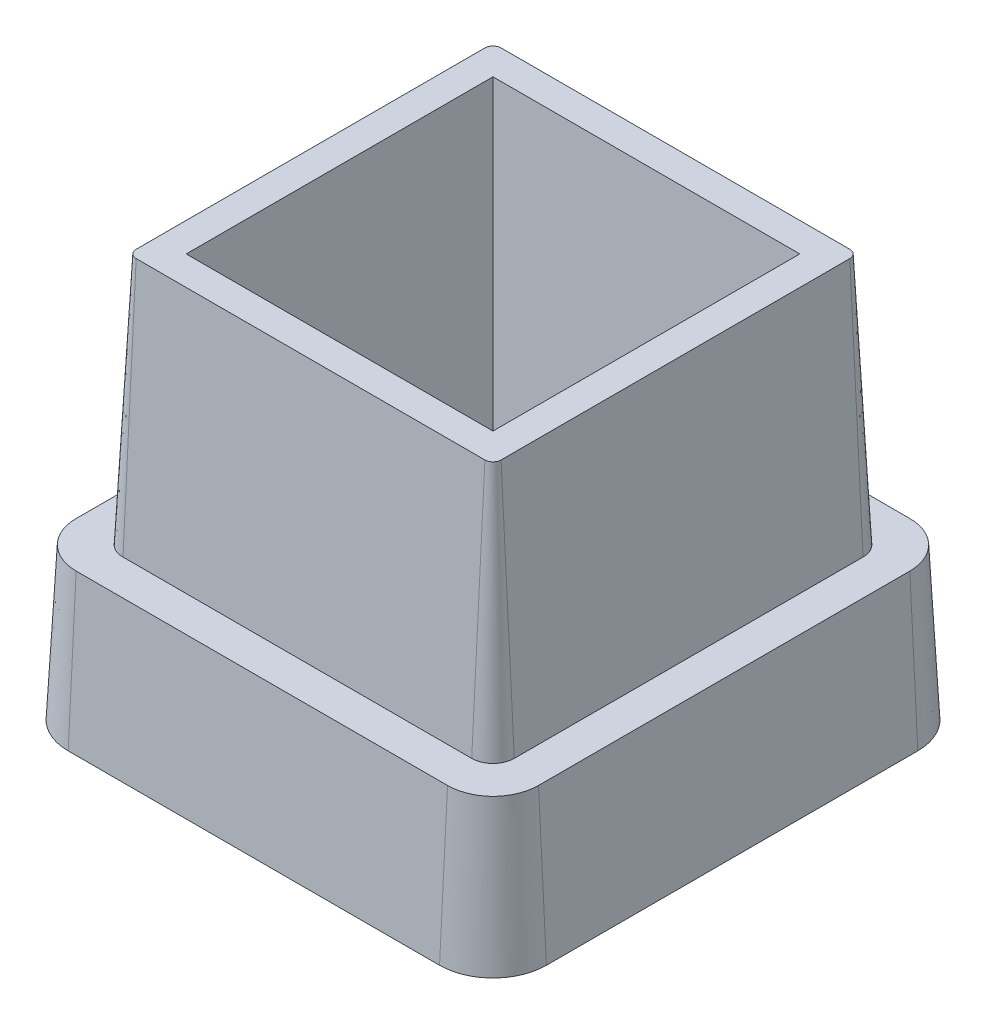
ISO-10303-21;
HEADER;
FILE_DESCRIPTION(('STEP AP214'),'2;1');
FILE_NAME('part.step','',(''),(''),'','','');
FILE_SCHEMA(('AUTOMOTIVE_DESIGN { 1 0 10303 214 1 1 1 1 }'));
ENDSEC;
DATA;
#1=APPLICATION_CONTEXT('core data for automotive mechanical design processes');
#2=APPLICATION_PROTOCOL_DEFINITION('international standard','automotive_design',2000,#1);
#3=PRODUCT_CONTEXT('',#1,'mechanical');
#4=PRODUCT('Part','Part','',(#3));
#5=PRODUCT_RELATED_PRODUCT_CATEGORY('part','',(#4));
#6=PRODUCT_DEFINITION_FORMATION('','',#4);
#7=PRODUCT_DEFINITION_CONTEXT('part definition',#1,'design');
#8=PRODUCT_DEFINITION('design','',#6,#7);
#9=PRODUCT_DEFINITION_SHAPE('','',#8);
#10=(LENGTH_UNIT() NAMED_UNIT(*) SI_UNIT(.MILLI.,.METRE.));
#11=(NAMED_UNIT(*) PLANE_ANGLE_UNIT() SI_UNIT($,.RADIAN.));
#12=(NAMED_UNIT(*) SI_UNIT($,.STERADIAN.) SOLID_ANGLE_UNIT());
#13=UNCERTAINTY_MEASURE_WITH_UNIT(LENGTH_MEASURE(1.E-05),#10,'distance_accuracy_value','');
#14=(GEOMETRIC_REPRESENTATION_CONTEXT(3) GLOBAL_UNCERTAINTY_ASSIGNED_CONTEXT((#13)) GLOBAL_UNIT_ASSIGNED_CONTEXT((#10,
#11,#12)) REPRESENTATION_CONTEXT('',''));
#15=CARTESIAN_POINT('',(0.,0.,0.));
#16=DIRECTION('',(0.,0.,1.));
#17=DIRECTION('',(1.,0.,0.));
#18=AXIS2_PLACEMENT_3D('',#15,#16,#17);
#19=CARTESIAN_POINT('',(-13.5,25.,0.));
#20=DIRECTION('',(-0.998629534754574,0.0523359562429439,0.));
#21=DIRECTION('',(-0.052335956242944,-0.998629534754574,0.));
#22=AXIS2_PLACEMENT_3D('',#19,#20,#21);
#23=PLANE('',#22);
#24=DIRECTION('',(0.,0.,-1.));
#25=VECTOR('',#24,1.);
#26=CARTESIAN_POINT('',(-14.810194482076,0.,0.));
#27=LINE('',#26,#25);
#28=CARTESIAN_POINT('',(-14.810194482076,0.,-11.5));
#29=VERTEX_POINT('',#28);
#30=CARTESIAN_POINT('',(-14.810194482076,0.,11.5));
#31=VERTEX_POINT('',#30);
#32=EDGE_CURVE('E259',#29,#31,#27,.F.);
#33=ORIENTED_EDGE('',*,*,#32,.T.);
#34=DIRECTION('',(-0.0523359562429439,-0.998629534754574,0.));
#35=VECTOR('',#34,1.);
#36=CARTESIAN_POINT('',(-13.5,25.,11.5));
#37=LINE('',#36,#35);
#38=CARTESIAN_POINT('',(-14.3175613568155,9.4,11.5));
#39=VERTEX_POINT('',#38);
#40=EDGE_CURVE('E211',#31,#39,#37,.F.);
#41=ORIENTED_EDGE('',*,*,#40,.T.);
#42=DIRECTION('',(0.,0.,-1.));
#43=VECTOR('',#42,1.);
#44=CARTESIAN_POINT('',(-14.3175613568155,9.4,0.));
#45=LINE('',#44,#43);
#46=CARTESIAN_POINT('',(-14.3175613568155,9.4,-11.5));
#47=VERTEX_POINT('',#46);
#48=EDGE_CURVE('E261',#47,#39,#45,.F.);
#49=ORIENTED_EDGE('',*,*,#48,.F.);
#50=DIRECTION('',(-0.0523359562429439,-0.998629534754574,0.));
#51=VECTOR('',#50,1.);
#52=CARTESIAN_POINT('',(-13.5,25.,-11.5));
#53=LINE('',#52,#51);
#54=EDGE_CURVE('E214',#47,#29,#53,.T.);
#55=ORIENTED_EDGE('',*,*,#54,.T.);
#56=EDGE_LOOP('',(#33,#41,#49,#55));
#57=FACE_BOUND('',#56,.T.);
#58=ADVANCED_FACE('F35',(#57),#23,.T.);
#59=CARTESIAN_POINT('',(0.,25.,13.5));
#60=DIRECTION('',(0.,0.0523359562429439,0.998629534754574));
#61=DIRECTION('',(0.,-0.998629534754574,0.052335956242944));
#62=AXIS2_PLACEMENT_3D('',#59,#60,#61);
#63=PLANE('',#62);
#64=DIRECTION('',(-1.,0.,0.));
#65=VECTOR('',#64,1.);
#66=CARTESIAN_POINT('',(0.,9.4,14.3175613568154));
#67=LINE('',#66,#65);
#68=CARTESIAN_POINT('',(-11.5,9.4,14.3175613568154));
#69=VERTEX_POINT('',#68);
#70=CARTESIAN_POINT('',(11.5,9.4,14.3175613568154));
#71=VERTEX_POINT('',#70);
#72=EDGE_CURVE('E254',#69,#71,#67,.F.);
#73=ORIENTED_EDGE('',*,*,#72,.F.);
#74=DIRECTION('',(0.,-0.998629534754574,0.0523359562429439));
#75=VECTOR('',#74,1.);
#76=CARTESIAN_POINT('',(-11.5,25.,13.5));
#77=LINE('',#76,#75);
#78=CARTESIAN_POINT('',(-11.5,0.,14.810194482076));
#79=VERTEX_POINT('',#78);
#80=EDGE_CURVE('E209',#69,#79,#77,.T.);
#81=ORIENTED_EDGE('',*,*,#80,.T.);
#82=DIRECTION('',(-1.,0.,0.));
#83=VECTOR('',#82,1.);
#84=CARTESIAN_POINT('',(0.,0.,14.810194482076));
#85=LINE('',#84,#83);
#86=CARTESIAN_POINT('',(11.5,0.,14.810194482076));
#87=VERTEX_POINT('',#86);
#88=EDGE_CURVE('E273',#79,#87,#85,.F.);
#89=ORIENTED_EDGE('',*,*,#88,.T.);
#90=DIRECTION('',(0.,-0.998629534754574,0.0523359562429439));
#91=VECTOR('',#90,1.);
#92=CARTESIAN_POINT('',(11.5,25.,13.5));
#93=LINE('',#92,#91);
#94=EDGE_CURVE('E207',#87,#71,#93,.F.);
#95=ORIENTED_EDGE('',*,*,#94,.T.);
#96=EDGE_LOOP('',(#73,#81,#89,#95));
#97=FACE_BOUND('',#96,.T.);
#98=ADVANCED_FACE('F344',(#97),#63,.T.);
#99=CARTESIAN_POINT('',(13.5,25.,0.));
#100=DIRECTION('',(0.998629534754574,0.0523359562429439,0.));
#101=DIRECTION('',(-0.052335956242944,0.998629534754574,0.));
#102=AXIS2_PLACEMENT_3D('',#99,#100,#101);
#103=PLANE('',#102);
#104=DIRECTION('',(0.,0.,1.));
#105=VECTOR('',#104,1.);
#106=CARTESIAN_POINT('',(14.3175613568154,9.4,0.));
#107=LINE('',#106,#105);
#108=CARTESIAN_POINT('',(14.3175613568154,9.4,11.5));
#109=VERTEX_POINT('',#108);
#110=CARTESIAN_POINT('',(14.3175613568154,9.4,-11.5));
#111=VERTEX_POINT('',#110);
#112=EDGE_CURVE('E250',#109,#111,#107,.F.);
#113=ORIENTED_EDGE('',*,*,#112,.F.);
#114=DIRECTION('',(0.0523359562429439,-0.998629534754574,0.));
#115=VECTOR('',#114,1.);
#116=CARTESIAN_POINT('',(13.5,25.,11.5));
#117=LINE('',#116,#115);
#118=CARTESIAN_POINT('',(14.810194482076,0.,11.5));
#119=VERTEX_POINT('',#118);
#120=EDGE_CURVE('E205',#109,#119,#117,.T.);
#121=ORIENTED_EDGE('',*,*,#120,.T.);
#122=DIRECTION('',(0.,0.,1.));
#123=VECTOR('',#122,1.);
#124=CARTESIAN_POINT('',(14.810194482076,0.,0.));
#125=LINE('',#124,#123);
#126=CARTESIAN_POINT('',(14.810194482076,0.,-11.5));
#127=VERTEX_POINT('',#126);
#128=EDGE_CURVE('E269',#119,#127,#125,.F.);
#129=ORIENTED_EDGE('',*,*,#128,.T.);
#130=DIRECTION('',(0.0523359562429439,-0.998629534754574,0.));
#131=VECTOR('',#130,1.);
#132=CARTESIAN_POINT('',(13.5,25.,-11.5));
#133=LINE('',#132,#131);
#134=EDGE_CURVE('E202',#127,#111,#133,.F.);
#135=ORIENTED_EDGE('',*,*,#134,.T.);
#136=EDGE_LOOP('',(#113,#121,#129,#135));
#137=FACE_BOUND('',#136,.T.);
#138=ADVANCED_FACE('F350',(#137),#103,.T.);
#139=CARTESIAN_POINT('',(0.,25.,-13.5));
#140=DIRECTION('',(0.,0.0523359562429439,-0.998629534754574));
#141=DIRECTION('',(0.,0.998629534754574,0.052335956242944));
#142=AXIS2_PLACEMENT_3D('',#139,#140,#141);
#143=PLANE('',#142);
#144=DIRECTION('',(1.,0.,0.));
#145=VECTOR('',#144,1.);
#146=CARTESIAN_POINT('',(0.,9.4,-14.3175613568154));
#147=LINE('',#146,#145);
#148=CARTESIAN_POINT('',(11.5,9.4,-14.3175613568154));
#149=VERTEX_POINT('',#148);
#150=CARTESIAN_POINT('',(-11.5,9.4,-14.3175613568154));
#151=VERTEX_POINT('',#150);
#152=EDGE_CURVE('E253',#149,#151,#147,.F.);
#153=ORIENTED_EDGE('',*,*,#152,.F.);
#154=DIRECTION('',(0.,-0.998629534754574,-0.0523359562429439));
#155=VECTOR('',#154,1.);
#156=CARTESIAN_POINT('',(11.5,25.,-13.5));
#157=LINE('',#156,#155);
#158=CARTESIAN_POINT('',(11.5,0.,-14.810194482076));
#159=VERTEX_POINT('',#158);
#160=EDGE_CURVE('E11',#149,#159,#157,.T.);
#161=ORIENTED_EDGE('',*,*,#160,.T.);
#162=DIRECTION('',(1.,0.,0.));
#163=VECTOR('',#162,1.);
#164=CARTESIAN_POINT('',(0.,0.,-14.810194482076));
#165=LINE('',#164,#163);
#166=CARTESIAN_POINT('',(-11.5,0.,-14.810194482076));
#167=VERTEX_POINT('',#166);
#168=EDGE_CURVE('E272',#159,#167,#165,.F.);
#169=ORIENTED_EDGE('',*,*,#168,.T.);
#170=DIRECTION('',(0.,-0.998629534754574,-0.0523359562429439));
#171=VECTOR('',#170,1.);
#172=CARTESIAN_POINT('',(-11.5,25.,-13.5));
#173=LINE('',#172,#171);
#174=EDGE_CURVE('E45',#167,#151,#173,.F.);
#175=ORIENTED_EDGE('',*,*,#174,.T.);
#176=EDGE_LOOP('',(#153,#161,#169,#175));
#177=FACE_BOUND('',#176,.T.);
#178=ADVANCED_FACE('F392',(#177),#143,.T.);
#179=CARTESIAN_POINT('',(0.,0.,0.));
#180=DIRECTION('',(0.,1.,0.));
#181=DIRECTION('',(0.,0.,1.));
#182=AXIS2_PLACEMENT_3D('',#179,#180,#181);
#183=PLANE('',#182);
#184=ORIENTED_EDGE('',*,*,#88,.F.);
#185=CARTESIAN_POINT('',(-11.5,0.,11.5));
#186=DIRECTION('',(0.,1.,0.));
#187=DIRECTION('',(0.,0.,1.));
#188=AXIS2_PLACEMENT_3D('',#185,#186,#187);
#189=CIRCLE('',#188,3.31019448207603);
#190=EDGE_CURVE('E248',#79,#31,#189,.F.);
#191=ORIENTED_EDGE('',*,*,#190,.T.);
#192=ORIENTED_EDGE('',*,*,#32,.F.);
#193=CARTESIAN_POINT('',(-11.5,0.,-11.5));
#194=DIRECTION('',(0.,1.,0.));
#195=DIRECTION('',(0.,0.,1.));
#196=AXIS2_PLACEMENT_3D('',#193,#194,#195);
#197=CIRCLE('',#196,3.31019448207603);
#198=EDGE_CURVE('E246',#29,#167,#197,.F.);
#199=ORIENTED_EDGE('',*,*,#198,.T.);
#200=ORIENTED_EDGE('',*,*,#168,.F.);
#201=CARTESIAN_POINT('',(11.5,0.,-11.5));
#202=DIRECTION('',(0.,1.,0.));
#203=DIRECTION('',(0.,0.,1.));
#204=AXIS2_PLACEMENT_3D('',#201,#202,#203);
#205=CIRCLE('',#204,3.31019448207603);
#206=EDGE_CURVE('E276',#159,#127,#205,.F.);
#207=ORIENTED_EDGE('',*,*,#206,.T.);
#208=ORIENTED_EDGE('',*,*,#128,.F.);
#209=CARTESIAN_POINT('',(11.5,0.,11.5));
#210=DIRECTION('',(0.,1.,0.));
#211=DIRECTION('',(0.,0.,1.));
#212=AXIS2_PLACEMENT_3D('',#209,#210,#211);
#213=CIRCLE('',#212,3.31019448207603);
#214=EDGE_CURVE('E274',#119,#87,#213,.F.);
#215=ORIENTED_EDGE('',*,*,#214,.T.);
#216=EDGE_LOOP('',(#184,#191,#192,#199,#200,#207,#208,#215));
#217=FACE_BOUND('',#216,.T.);
#218=ADVANCED_FACE('F394',(#217),#183,.F.);
#219=CARTESIAN_POINT('',(0.,9.4,0.));
#220=DIRECTION('',(0.,1.,0.));
#221=DIRECTION('',(0.,0.,1.));
#222=AXIS2_PLACEMENT_3D('',#219,#220,#221);
#223=PLANE('',#222);
#224=DIRECTION('',(0.,0.,1.));
#225=VECTOR('',#224,1.);
#226=CARTESIAN_POINT('',(-12.1175613568155,9.4,0.));
#227=LINE('',#226,#225);
#228=CARTESIAN_POINT('',(-12.1175613568155,9.4,-10.8));
#229=VERTEX_POINT('',#228);
#230=CARTESIAN_POINT('',(-12.1175613568155,9.4,10.8));
#231=VERTEX_POINT('',#230);
#232=EDGE_CURVE('E264',#229,#231,#227,.T.);
#233=ORIENTED_EDGE('',*,*,#232,.F.);
#234=CARTESIAN_POINT('',(-10.8,9.4,-10.8));
#235=DIRECTION('',(0.,1.,0.));
#236=DIRECTION('',(0.,0.,1.));
#237=AXIS2_PLACEMENT_3D('',#234,#235,#236);
#238=CIRCLE('',#237,1.31756135681544);
#239=CARTESIAN_POINT('',(-10.8,9.4,-12.1175613568154));
#240=VERTEX_POINT('',#239);
#241=EDGE_CURVE('E290',#229,#240,#238,.F.);
#242=ORIENTED_EDGE('',*,*,#241,.T.);
#243=DIRECTION('',(-1.,0.,0.));
#244=VECTOR('',#243,1.);
#245=CARTESIAN_POINT('',(0.,9.4,-12.1175613568154));
#246=LINE('',#245,#244);
#247=CARTESIAN_POINT('',(10.8,9.4,-12.1175613568154));
#248=VERTEX_POINT('',#247);
#249=EDGE_CURVE('E293',#248,#240,#246,.T.);
#250=ORIENTED_EDGE('',*,*,#249,.F.);
#251=CARTESIAN_POINT('',(10.8,9.4,-10.8));
#252=DIRECTION('',(0.,1.,0.));
#253=DIRECTION('',(0.,0.,1.));
#254=AXIS2_PLACEMENT_3D('',#251,#252,#253);
#255=CIRCLE('',#254,1.31756135681544);
#256=CARTESIAN_POINT('',(12.1175613568154,9.4,-10.8));
#257=VERTEX_POINT('',#256);
#258=EDGE_CURVE('E210',#248,#257,#255,.F.);
#259=ORIENTED_EDGE('',*,*,#258,.T.);
#260=DIRECTION('',(0.,0.,-1.));
#261=VECTOR('',#260,1.);
#262=CARTESIAN_POINT('',(12.1175613568154,9.4,0.));
#263=LINE('',#262,#261);
#264=CARTESIAN_POINT('',(12.1175613568154,9.4,10.8));
#265=VERTEX_POINT('',#264);
#266=EDGE_CURVE('E296',#265,#257,#263,.T.);
#267=ORIENTED_EDGE('',*,*,#266,.F.);
#268=CARTESIAN_POINT('',(10.8,9.4,10.8));
#269=DIRECTION('',(0.,1.,0.));
#270=DIRECTION('',(0.,0.,1.));
#271=AXIS2_PLACEMENT_3D('',#268,#269,#270);
#272=CIRCLE('',#271,1.31756135681544);
#273=CARTESIAN_POINT('',(10.8,9.4,12.1175613568154));
#274=VERTEX_POINT('',#273);
#275=EDGE_CURVE('E292',#265,#274,#272,.F.);
#276=ORIENTED_EDGE('',*,*,#275,.T.);
#277=DIRECTION('',(1.,0.,0.));
#278=VECTOR('',#277,1.);
#279=CARTESIAN_POINT('',(0.,9.4,12.1175613568154));
#280=LINE('',#279,#278);
#281=CARTESIAN_POINT('',(-10.8,9.4,12.1175613568154));
#282=VERTEX_POINT('',#281);
#283=EDGE_CURVE('E300',#282,#274,#280,.T.);
#284=ORIENTED_EDGE('',*,*,#283,.F.);
#285=CARTESIAN_POINT('',(-10.8,9.4,10.8));
#286=DIRECTION('',(0.,1.,0.));
#287=DIRECTION('',(0.,0.,1.));
#288=AXIS2_PLACEMENT_3D('',#285,#286,#287);
#289=CIRCLE('',#288,1.31756135681544);
#290=EDGE_CURVE('E288',#282,#231,#289,.F.);
#291=ORIENTED_EDGE('',*,*,#290,.T.);
#292=EDGE_LOOP('',(#233,#242,#250,#259,#267,#276,#284,#291));
#293=FACE_BOUND('',#292,.T.);
#294=ORIENTED_EDGE('',*,*,#48,.T.);
#295=CARTESIAN_POINT('',(-11.5,9.4,11.5));
#296=DIRECTION('',(0.,1.,0.));
#297=DIRECTION('',(0.,0.,1.));
#298=AXIS2_PLACEMENT_3D('',#295,#296,#297);
#299=CIRCLE('',#298,2.81756135681544);
#300=EDGE_CURVE('E206',#39,#69,#299,.T.);
#301=ORIENTED_EDGE('',*,*,#300,.T.);
#302=ORIENTED_EDGE('',*,*,#72,.T.);
#303=CARTESIAN_POINT('',(11.5,9.4,11.5));
#304=DIRECTION('',(0.,1.,0.));
#305=DIRECTION('',(0.,0.,1.));
#306=AXIS2_PLACEMENT_3D('',#303,#304,#305);
#307=CIRCLE('',#306,2.81756135681544);
#308=EDGE_CURVE('E257',#71,#109,#307,.T.);
#309=ORIENTED_EDGE('',*,*,#308,.T.);
#310=ORIENTED_EDGE('',*,*,#112,.T.);
#311=CARTESIAN_POINT('',(11.5,9.4,-11.5));
#312=DIRECTION('',(0.,1.,0.));
#313=DIRECTION('',(0.,0.,1.));
#314=AXIS2_PLACEMENT_3D('',#311,#312,#313);
#315=CIRCLE('',#314,2.81756135681544);
#316=EDGE_CURVE('E255',#111,#149,#315,.T.);
#317=ORIENTED_EDGE('',*,*,#316,.T.);
#318=ORIENTED_EDGE('',*,*,#152,.T.);
#319=CARTESIAN_POINT('',(-11.5,9.4,-11.5));
#320=DIRECTION('',(0.,1.,0.));
#321=DIRECTION('',(0.,0.,1.));
#322=AXIS2_PLACEMENT_3D('',#319,#320,#321);
#323=CIRCLE('',#322,2.81756135681544);
#324=EDGE_CURVE('E213',#151,#47,#323,.T.);
#325=ORIENTED_EDGE('',*,*,#324,.T.);
#326=EDGE_LOOP('',(#294,#301,#302,#309,#310,#317,#318,#325));
#327=FACE_BOUND('',#326,.T.);
#328=ADVANCED_FACE('F383',(#293,#327),#223,.T.);
#329=CARTESIAN_POINT('',(0.,25.,11.3));
#330=DIRECTION('',(0.,0.0523359562429439,0.998629534754574));
#331=DIRECTION('',(0.,-0.998629534754574,0.052335956242944));
#332=AXIS2_PLACEMENT_3D('',#329,#330,#331);
#333=PLANE('',#332);
#334=DIRECTION('',(1.,0.,0.));
#335=VECTOR('',#334,1.);
#336=CARTESIAN_POINT('',(0.,25.,11.3));
#337=LINE('',#336,#335);
#338=CARTESIAN_POINT('',(-10.8,25.,11.3));
#339=VERTEX_POINT('',#338);
#340=CARTESIAN_POINT('',(10.8,25.,11.3));
#341=VERTEX_POINT('',#340);
#342=EDGE_CURVE('E309',#339,#341,#337,.T.);
#343=ORIENTED_EDGE('',*,*,#342,.F.);
#344=DIRECTION('',(0.,-0.998629534754574,0.0523359562429439));
#345=VECTOR('',#344,1.);
#346=CARTESIAN_POINT('',(-10.8,25.,11.3));
#347=LINE('',#346,#345);
#348=EDGE_CURVE('E226',#339,#282,#347,.T.);
#349=ORIENTED_EDGE('',*,*,#348,.T.);
#350=ORIENTED_EDGE('',*,*,#283,.T.);
#351=DIRECTION('',(0.,-0.998629534754574,0.0523359562429439));
#352=VECTOR('',#351,1.);
#353=CARTESIAN_POINT('',(10.8,25.,11.3));
#354=LINE('',#353,#352);
#355=EDGE_CURVE('E224',#274,#341,#354,.F.);
#356=ORIENTED_EDGE('',*,*,#355,.T.);
#357=EDGE_LOOP('',(#343,#349,#350,#356));
#358=FACE_BOUND('',#357,.T.);
#359=ADVANCED_FACE('F361',(#358),#333,.T.);
#360=CARTESIAN_POINT('',(-11.3,25.,0.));
#361=DIRECTION('',(-0.998629534754574,0.0523359562429439,0.));
#362=DIRECTION('',(-0.052335956242944,-0.998629534754574,0.));
#363=AXIS2_PLACEMENT_3D('',#360,#361,#362);
#364=PLANE('',#363);
#365=ORIENTED_EDGE('',*,*,#232,.T.);
#366=DIRECTION('',(-0.0523359562429439,-0.998629534754574,0.));
#367=VECTOR('',#366,1.);
#368=CARTESIAN_POINT('',(-11.3,25.,10.8));
#369=LINE('',#368,#367);
#370=CARTESIAN_POINT('',(-11.3,25.,10.8));
#371=VERTEX_POINT('',#370);
#372=EDGE_CURVE('E220',#231,#371,#369,.F.);
#373=ORIENTED_EDGE('',*,*,#372,.T.);
#374=DIRECTION('',(0.,0.,1.));
#375=VECTOR('',#374,1.);
#376=CARTESIAN_POINT('',(-11.3,25.,0.));
#377=LINE('',#376,#375);
#378=CARTESIAN_POINT('',(-11.3,25.,-10.8));
#379=VERTEX_POINT('',#378);
#380=EDGE_CURVE('E303',#379,#371,#377,.T.);
#381=ORIENTED_EDGE('',*,*,#380,.F.);
#382=DIRECTION('',(-0.0523359562429439,-0.998629534754574,0.));
#383=VECTOR('',#382,1.);
#384=CARTESIAN_POINT('',(-11.3,25.,-10.8));
#385=LINE('',#384,#383);
#386=EDGE_CURVE('E223',#379,#229,#385,.T.);
#387=ORIENTED_EDGE('',*,*,#386,.T.);
#388=EDGE_LOOP('',(#365,#373,#381,#387));
#389=FACE_BOUND('',#388,.T.);
#390=ADVANCED_FACE('F357',(#389),#364,.T.);
#391=CARTESIAN_POINT('',(0.,25.,-11.3));
#392=DIRECTION('',(0.,0.0523359562429439,-0.998629534754574));
#393=DIRECTION('',(0.,0.998629534754574,0.052335956242944));
#394=AXIS2_PLACEMENT_3D('',#391,#392,#393);
#395=PLANE('',#394);
#396=ORIENTED_EDGE('',*,*,#249,.T.);
#397=DIRECTION('',(0.,-0.998629534754574,-0.0523359562429439));
#398=VECTOR('',#397,1.);
#399=CARTESIAN_POINT('',(-10.8,25.,-11.3));
#400=LINE('',#399,#398);
#401=CARTESIAN_POINT('',(-10.8,25.,-11.3));
#402=VERTEX_POINT('',#401);
#403=EDGE_CURVE('E216',#240,#402,#400,.F.);
#404=ORIENTED_EDGE('',*,*,#403,.T.);
#405=DIRECTION('',(-1.,0.,0.));
#406=VECTOR('',#405,1.);
#407=CARTESIAN_POINT('',(0.,25.,-11.3));
#408=LINE('',#407,#406);
#409=CARTESIAN_POINT('',(10.8,25.,-11.3));
#410=VERTEX_POINT('',#409);
#411=EDGE_CURVE('E308',#410,#402,#408,.T.);
#412=ORIENTED_EDGE('',*,*,#411,.F.);
#413=DIRECTION('',(0.,-0.998629534754574,-0.0523359562429439));
#414=VECTOR('',#413,1.);
#415=CARTESIAN_POINT('',(10.8,25.,-11.3));
#416=LINE('',#415,#414);
#417=EDGE_CURVE('E219',#410,#248,#416,.T.);
#418=ORIENTED_EDGE('',*,*,#417,.T.);
#419=EDGE_LOOP('',(#396,#404,#412,#418));
#420=FACE_BOUND('',#419,.T.);
#421=ADVANCED_FACE('F360',(#420),#395,.T.);
#422=CARTESIAN_POINT('',(11.3,25.,0.));
#423=DIRECTION('',(0.998629534754574,0.0523359562429439,0.));
#424=DIRECTION('',(-0.052335956242944,0.998629534754574,0.));
#425=AXIS2_PLACEMENT_3D('',#422,#423,#424);
#426=PLANE('',#425);
#427=DIRECTION('',(0.,0.,-1.));
#428=VECTOR('',#427,1.);
#429=CARTESIAN_POINT('',(11.3,25.,0.));
#430=LINE('',#429,#428);
#431=CARTESIAN_POINT('',(11.3,25.,10.8));
#432=VERTEX_POINT('',#431);
#433=CARTESIAN_POINT('',(11.3,25.,-10.8));
#434=VERTEX_POINT('',#433);
#435=EDGE_CURVE('E311',#432,#434,#430,.T.);
#436=ORIENTED_EDGE('',*,*,#435,.F.);
#437=DIRECTION('',(0.0523359562429439,-0.998629534754574,0.));
#438=VECTOR('',#437,1.);
#439=CARTESIAN_POINT('',(11.3,25.,10.8));
#440=LINE('',#439,#438);
#441=EDGE_CURVE('E286',#432,#265,#440,.T.);
#442=ORIENTED_EDGE('',*,*,#441,.T.);
#443=ORIENTED_EDGE('',*,*,#266,.T.);
#444=DIRECTION('',(0.0523359562429439,-0.998629534754574,0.));
#445=VECTOR('',#444,1.);
#446=CARTESIAN_POINT('',(11.3,25.,-10.8));
#447=LINE('',#446,#445);
#448=EDGE_CURVE('E39',#257,#434,#447,.F.);
#449=ORIENTED_EDGE('',*,*,#448,.T.);
#450=EDGE_LOOP('',(#436,#442,#443,#449));
#451=FACE_BOUND('',#450,.T.);
#452=ADVANCED_FACE('F339',(#451),#426,.T.);
#453=CARTESIAN_POINT('',(0.,25.,0.));
#454=DIRECTION('',(0.,1.,0.));
#455=DIRECTION('',(0.,0.,1.));
#456=AXIS2_PLACEMENT_3D('',#453,#454,#455);
#457=PLANE('',#456);
#458=DIRECTION('',(0.,0.,-1.));
#459=VECTOR('',#458,1.);
#460=CARTESIAN_POINT('',(-9.5,25.,0.));
#461=LINE('',#460,#459);
#462=CARTESIAN_POINT('',(-9.5,25.,-9.5));
#463=VERTEX_POINT('',#462);
#464=CARTESIAN_POINT('',(-9.5,25.,9.5));
#465=VERTEX_POINT('',#464);
#466=EDGE_CURVE('E323',#463,#465,#461,.F.);
#467=ORIENTED_EDGE('',*,*,#466,.F.);
#468=DIRECTION('',(1.,0.,0.));
#469=VECTOR('',#468,1.);
#470=CARTESIAN_POINT('',(0.,25.,-9.5));
#471=LINE('',#470,#469);
#472=CARTESIAN_POINT('',(9.5,25.,-9.50000000000001));
#473=VERTEX_POINT('',#472);
#474=EDGE_CURVE('E198',#473,#463,#471,.F.);
#475=ORIENTED_EDGE('',*,*,#474,.F.);
#476=DIRECTION('',(0.,0.,1.));
#477=VECTOR('',#476,1.);
#478=CARTESIAN_POINT('',(9.5,25.,0.));
#479=LINE('',#478,#477);
#480=CARTESIAN_POINT('',(9.5,25.,9.5));
#481=VERTEX_POINT('',#480);
#482=EDGE_CURVE('E320',#481,#473,#479,.F.);
#483=ORIENTED_EDGE('',*,*,#482,.F.);
#484=DIRECTION('',(-1.,0.,0.));
#485=VECTOR('',#484,1.);
#486=CARTESIAN_POINT('',(0.,25.,9.49999999999999));
#487=LINE('',#486,#485);
#488=EDGE_CURVE('E181',#465,#481,#487,.F.);
#489=ORIENTED_EDGE('',*,*,#488,.F.);
#490=EDGE_LOOP('',(#467,#475,#483,#489));
#491=FACE_BOUND('',#490,.T.);
#492=ORIENTED_EDGE('',*,*,#380,.T.);
#493=CARTESIAN_POINT('',(-10.8,25.,10.8));
#494=DIRECTION('',(0.,1.,0.));
#495=DIRECTION('',(0.,0.,1.));
#496=AXIS2_PLACEMENT_3D('',#493,#494,#495);
#497=CIRCLE('',#496,0.5);
#498=EDGE_CURVE('E227',#371,#339,#497,.T.);
#499=ORIENTED_EDGE('',*,*,#498,.T.);
#500=ORIENTED_EDGE('',*,*,#342,.T.);
#501=CARTESIAN_POINT('',(10.8,25.,10.8));
#502=DIRECTION('',(0.,1.,0.));
#503=DIRECTION('',(0.,0.,1.));
#504=AXIS2_PLACEMENT_3D('',#501,#502,#503);
#505=CIRCLE('',#504,0.5);
#506=EDGE_CURVE('E238',#341,#432,#505,.T.);
#507=ORIENTED_EDGE('',*,*,#506,.T.);
#508=ORIENTED_EDGE('',*,*,#435,.T.);
#509=CARTESIAN_POINT('',(10.8,25.,-10.8));
#510=DIRECTION('',(0.,1.,0.));
#511=DIRECTION('',(0.,0.,1.));
#512=AXIS2_PLACEMENT_3D('',#509,#510,#511);
#513=CIRCLE('',#512,0.5);
#514=EDGE_CURVE('E222',#434,#410,#513,.T.);
#515=ORIENTED_EDGE('',*,*,#514,.T.);
#516=ORIENTED_EDGE('',*,*,#411,.T.);
#517=CARTESIAN_POINT('',(-10.8,25.,-10.8));
#518=DIRECTION('',(0.,1.,0.));
#519=DIRECTION('',(0.,0.,1.));
#520=AXIS2_PLACEMENT_3D('',#517,#518,#519);
#521=CIRCLE('',#520,0.5);
#522=EDGE_CURVE('E234',#402,#379,#521,.T.);
#523=ORIENTED_EDGE('',*,*,#522,.T.);
#524=EDGE_LOOP('',(#492,#499,#500,#507,#508,#515,#516,#523));
#525=FACE_BOUND('',#524,.T.);
#526=ADVANCED_FACE('F332',(#491,#525),#457,.T.);
#527=CARTESIAN_POINT('',(-9.5,25.,0.));
#528=DIRECTION('',(0.998629534754574,0.0523359562429439,0.));
#529=DIRECTION('',(-0.052335956242944,0.998629534754574,0.));
#530=AXIS2_PLACEMENT_3D('',#527,#528,#529);
#531=PLANE('',#530);
#532=ORIENTED_EDGE('',*,*,#466,.T.);
#533=DIRECTION('',(-0.052264427688714,0.997264688634237,0.052264427688714));
#534=VECTOR('',#533,1.);
#535=CARTESIAN_POINT('',(-9.47405008118453,24.5048460520465,9.47405008118452));
#536=LINE('',#535,#534);
#537=CARTESIAN_POINT('',(-8.30510263234666,2.2,8.30510263234665));
#538=VERTEX_POINT('',#537);
#539=EDGE_CURVE('E169',#538,#465,#536,.T.);
#540=ORIENTED_EDGE('',*,*,#539,.F.);
#541=DIRECTION('',(0.,0.,-1.));
#542=VECTOR('',#541,1.);
#543=CARTESIAN_POINT('',(-8.30510263234666,2.2,0.));
#544=LINE('',#543,#542);
#545=CARTESIAN_POINT('',(-8.30510263234666,2.2,-8.30510263234666));
#546=VERTEX_POINT('',#545);
#547=EDGE_CURVE('E196',#546,#538,#544,.F.);
#548=ORIENTED_EDGE('',*,*,#547,.F.);
#549=DIRECTION('',(-0.052264427688714,0.997264688634237,-0.052264427688714));
#550=VECTOR('',#549,1.);
#551=CARTESIAN_POINT('',(-9.47405008118453,24.5048460520465,-9.47405008118453));
#552=LINE('',#551,#550);
#553=EDGE_CURVE('E312',#546,#463,#552,.T.);
#554=ORIENTED_EDGE('',*,*,#553,.T.);
#555=EDGE_LOOP('',(#532,#540,#548,#554));
#556=FACE_BOUND('',#555,.T.);
#557=ADVANCED_FACE('F330',(#556),#531,.T.);
#558=CARTESIAN_POINT('',(0.,25.,-9.5));
#559=DIRECTION('',(0.,0.0523359562429439,0.998629534754574));
#560=DIRECTION('',(0.,-0.998629534754574,0.052335956242944));
#561=AXIS2_PLACEMENT_3D('',#558,#559,#560);
#562=PLANE('',#561);
#563=ORIENTED_EDGE('',*,*,#474,.T.);
#564=ORIENTED_EDGE('',*,*,#553,.F.);
#565=DIRECTION('',(1.,0.,0.));
#566=VECTOR('',#565,1.);
#567=CARTESIAN_POINT('',(0.,2.2,-8.30510263234666));
#568=LINE('',#567,#566);
#569=CARTESIAN_POINT('',(8.30510263234666,2.2,-8.30510263234666));
#570=VERTEX_POINT('',#569);
#571=EDGE_CURVE('E193',#570,#546,#568,.F.);
#572=ORIENTED_EDGE('',*,*,#571,.F.);
#573=DIRECTION('',(0.052264427688714,0.997264688634237,-0.052264427688714));
#574=VECTOR('',#573,1.);
#575=CARTESIAN_POINT('',(9.47405008118452,24.5048460520465,-9.47405008118453));
#576=LINE('',#575,#574);
#577=EDGE_CURVE('E185',#570,#473,#576,.T.);
#578=ORIENTED_EDGE('',*,*,#577,.T.);
#579=EDGE_LOOP('',(#563,#564,#572,#578));
#580=FACE_BOUND('',#579,.T.);
#581=ADVANCED_FACE('F327',(#580),#562,.T.);
#582=CARTESIAN_POINT('',(9.5,25.,0.));
#583=DIRECTION('',(-0.998629534754574,0.0523359562429439,0.));
#584=DIRECTION('',(-0.052335956242944,-0.998629534754574,0.));
#585=AXIS2_PLACEMENT_3D('',#582,#583,#584);
#586=PLANE('',#585);
#587=ORIENTED_EDGE('',*,*,#482,.T.);
#588=ORIENTED_EDGE('',*,*,#577,.F.);
#589=DIRECTION('',(0.,0.,1.));
#590=VECTOR('',#589,1.);
#591=CARTESIAN_POINT('',(8.30510263234665,2.2,0.));
#592=LINE('',#591,#590);
#593=CARTESIAN_POINT('',(8.30510263234666,2.2,8.30510263234665));
#594=VERTEX_POINT('',#593);
#595=EDGE_CURVE('E188',#594,#570,#592,.F.);
#596=ORIENTED_EDGE('',*,*,#595,.F.);
#597=DIRECTION('',(0.052264427688714,0.997264688634237,0.052264427688714));
#598=VECTOR('',#597,1.);
#599=CARTESIAN_POINT('',(9.47405008118452,24.5048460520465,9.47405008118452));
#600=LINE('',#599,#598);
#601=EDGE_CURVE('E174',#594,#481,#600,.T.);
#602=ORIENTED_EDGE('',*,*,#601,.T.);
#603=EDGE_LOOP('',(#587,#588,#596,#602));
#604=FACE_BOUND('',#603,.T.);
#605=ADVANCED_FACE('F189',(#604),#586,.T.);
#606=CARTESIAN_POINT('',(0.,25.,9.5));
#607=DIRECTION('',(0.,0.0523359562429439,-0.998629534754574));
#608=DIRECTION('',(0.,0.998629534754574,0.052335956242944));
#609=AXIS2_PLACEMENT_3D('',#606,#607,#608);
#610=PLANE('',#609);
#611=ORIENTED_EDGE('',*,*,#488,.T.);
#612=ORIENTED_EDGE('',*,*,#601,.F.);
#613=DIRECTION('',(-1.,0.,0.));
#614=VECTOR('',#613,1.);
#615=CARTESIAN_POINT('',(0.,2.2,8.30510263234665));
#616=LINE('',#615,#614);
#617=EDGE_CURVE('E178',#538,#594,#616,.F.);
#618=ORIENTED_EDGE('',*,*,#617,.F.);
#619=ORIENTED_EDGE('',*,*,#539,.T.);
#620=EDGE_LOOP('',(#611,#612,#618,#619));
#621=FACE_BOUND('',#620,.T.);
#622=ADVANCED_FACE('F176',(#621),#610,.T.);
#623=CARTESIAN_POINT('',(0.,2.2,0.));
#624=DIRECTION('',(0.,1.,0.));
#625=DIRECTION('',(0.,0.,1.));
#626=AXIS2_PLACEMENT_3D('',#623,#624,#625);
#627=PLANE('',#626);
#628=ORIENTED_EDGE('',*,*,#547,.T.);
#629=ORIENTED_EDGE('',*,*,#617,.T.);
#630=ORIENTED_EDGE('',*,*,#595,.T.);
#631=ORIENTED_EDGE('',*,*,#571,.T.);
#632=EDGE_LOOP('',(#628,#629,#630,#631));
#633=FACE_BOUND('',#632,.T.);
#634=ADVANCED_FACE('F195',(#633),#627,.T.);
#635=CARTESIAN_POINT('',(-10.8,25.,10.8));
#636=DIRECTION('',(0.,-1.,0.));
#637=DIRECTION('',(0.,0.,1.));
#638=AXIS2_PLACEMENT_3D('',#635,#636,#637);
#639=CONICAL_SURFACE('',#638,0.5,0.05235987755983);
#640=ORIENTED_EDGE('',*,*,#290,.F.);
#641=ORIENTED_EDGE('',*,*,#348,.F.);
#642=ORIENTED_EDGE('',*,*,#498,.F.);
#643=ORIENTED_EDGE('',*,*,#372,.F.);
#644=EDGE_LOOP('',(#640,#641,#642,#643));
#645=FACE_BOUND('',#644,.T.);
#646=ADVANCED_FACE('F363',(#645),#639,.T.);
#647=CARTESIAN_POINT('',(-10.8,25.,-10.8));
#648=DIRECTION('',(0.,-1.,0.));
#649=DIRECTION('',(0.,0.,1.));
#650=AXIS2_PLACEMENT_3D('',#647,#648,#649);
#651=CONICAL_SURFACE('',#650,0.5,0.05235987755983);
#652=ORIENTED_EDGE('',*,*,#241,.F.);
#653=ORIENTED_EDGE('',*,*,#386,.F.);
#654=ORIENTED_EDGE('',*,*,#522,.F.);
#655=ORIENTED_EDGE('',*,*,#403,.F.);
#656=EDGE_LOOP('',(#652,#653,#654,#655));
#657=FACE_BOUND('',#656,.T.);
#658=ADVANCED_FACE('F366',(#657),#651,.T.);
#659=CARTESIAN_POINT('',(10.8,25.,10.8));
#660=DIRECTION('',(0.,-1.,0.));
#661=DIRECTION('',(0.,0.,1.));
#662=AXIS2_PLACEMENT_3D('',#659,#660,#661);
#663=CONICAL_SURFACE('',#662,0.5,0.05235987755983);
#664=ORIENTED_EDGE('',*,*,#275,.F.);
#665=ORIENTED_EDGE('',*,*,#441,.F.);
#666=ORIENTED_EDGE('',*,*,#506,.F.);
#667=ORIENTED_EDGE('',*,*,#355,.F.);
#668=EDGE_LOOP('',(#664,#665,#666,#667));
#669=FACE_BOUND('',#668,.T.);
#670=ADVANCED_FACE('F377',(#669),#663,.T.);
#671=CARTESIAN_POINT('',(10.8,25.,-10.8));
#672=DIRECTION('',(0.,-1.,0.));
#673=DIRECTION('',(0.,0.,1.));
#674=AXIS2_PLACEMENT_3D('',#671,#672,#673);
#675=CONICAL_SURFACE('',#674,0.5,0.05235987755983);
#676=ORIENTED_EDGE('',*,*,#258,.F.);
#677=ORIENTED_EDGE('',*,*,#417,.F.);
#678=ORIENTED_EDGE('',*,*,#514,.F.);
#679=ORIENTED_EDGE('',*,*,#448,.F.);
#680=EDGE_LOOP('',(#676,#677,#678,#679));
#681=FACE_BOUND('',#680,.T.);
#682=ADVANCED_FACE('F371',(#681),#675,.T.);
#683=CARTESIAN_POINT('',(-11.5,25.,11.5));
#684=DIRECTION('',(0.,-1.,0.));
#685=DIRECTION('',(0.,0.,1.));
#686=AXIS2_PLACEMENT_3D('',#683,#684,#685);
#687=CONICAL_SURFACE('',#686,2.,0.05235987755983);
#688=ORIENTED_EDGE('',*,*,#300,.F.);
#689=ORIENTED_EDGE('',*,*,#40,.F.);
#690=ORIENTED_EDGE('',*,*,#190,.F.);
#691=ORIENTED_EDGE('',*,*,#80,.F.);
#692=EDGE_LOOP('',(#688,#689,#690,#691));
#693=FACE_BOUND('',#692,.T.);
#694=ADVANCED_FACE('F368',(#693),#687,.T.);
#695=CARTESIAN_POINT('',(11.5,25.,11.5));
#696=DIRECTION('',(0.,-1.,0.));
#697=DIRECTION('',(0.,0.,1.));
#698=AXIS2_PLACEMENT_3D('',#695,#696,#697);
#699=CONICAL_SURFACE('',#698,2.,0.05235987755983);
#700=ORIENTED_EDGE('',*,*,#308,.F.);
#701=ORIENTED_EDGE('',*,*,#94,.F.);
#702=ORIENTED_EDGE('',*,*,#214,.F.);
#703=ORIENTED_EDGE('',*,*,#120,.F.);
#704=EDGE_LOOP('',(#700,#701,#702,#703));
#705=FACE_BOUND('',#704,.T.);
#706=ADVANCED_FACE('F370',(#705),#699,.T.);
#707=CARTESIAN_POINT('',(11.5,25.,-11.5));
#708=DIRECTION('',(0.,-1.,0.));
#709=DIRECTION('',(0.,0.,1.));
#710=AXIS2_PLACEMENT_3D('',#707,#708,#709);
#711=CONICAL_SURFACE('',#710,2.,0.05235987755983);
#712=ORIENTED_EDGE('',*,*,#316,.F.);
#713=ORIENTED_EDGE('',*,*,#134,.F.);
#714=ORIENTED_EDGE('',*,*,#206,.F.);
#715=ORIENTED_EDGE('',*,*,#160,.F.);
#716=EDGE_LOOP('',(#712,#713,#714,#715));
#717=FACE_BOUND('',#716,.T.);
#718=ADVANCED_FACE('F37',(#717),#711,.T.);
#719=CARTESIAN_POINT('',(-11.5,25.,-11.5));
#720=DIRECTION('',(0.,-1.,0.));
#721=DIRECTION('',(0.,0.,1.));
#722=AXIS2_PLACEMENT_3D('',#719,#720,#721);
#723=CONICAL_SURFACE('',#722,2.,0.05235987755983);
#724=ORIENTED_EDGE('',*,*,#324,.F.);
#725=ORIENTED_EDGE('',*,*,#174,.F.);
#726=ORIENTED_EDGE('',*,*,#198,.F.);
#727=ORIENTED_EDGE('',*,*,#54,.F.);
#728=EDGE_LOOP('',(#724,#725,#726,#727));
#729=FACE_BOUND('',#728,.T.);
#730=ADVANCED_FACE('F355',(#729),#723,.T.);
#731=CLOSED_SHELL('',(#58,#98,#138,#178,#218,#328,#359,#390,#421,#452,#526,#557,#581,#605,#622,
#634,#646,#658,#670,#682,#694,#706,#718,#730));
#732=MANIFOLD_SOLID_BREP('B2',#731);
#733=ADVANCED_BREP_SHAPE_REPRESENTATION('',(#18,#732),#14);
#734=SHAPE_DEFINITION_REPRESENTATION(#9,#733);
ENDSEC;
END-ISO-10303-21;
